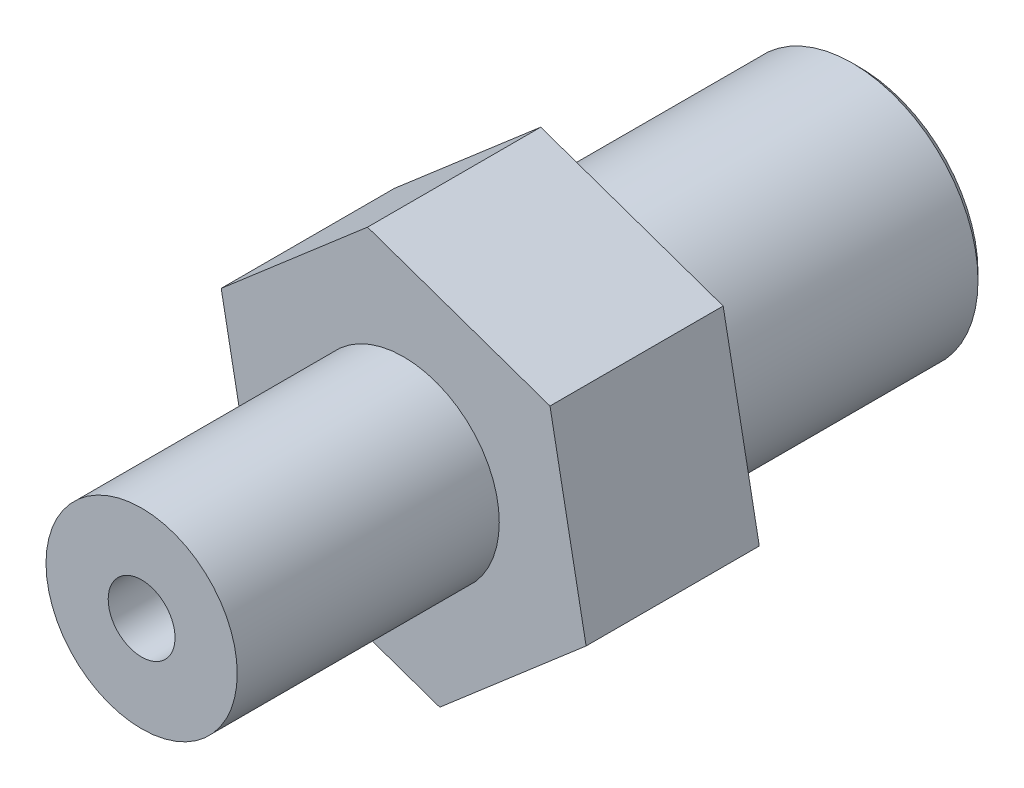
ISO-10303-21;
HEADER;
FILE_DESCRIPTION(('STEP AP214'),'2;1');
FILE_NAME('part.step','',(''),(''),'','','');
FILE_SCHEMA(('AUTOMOTIVE_DESIGN { 1 0 10303 214 1 1 1 1 }'));
ENDSEC;
DATA;
#1=APPLICATION_CONTEXT('core data for automotive mechanical design processes');
#2=APPLICATION_PROTOCOL_DEFINITION('international standard','automotive_design',2000,#1);
#3=PRODUCT_CONTEXT('',#1,'mechanical');
#4=PRODUCT('Part','Part','',(#3));
#5=PRODUCT_RELATED_PRODUCT_CATEGORY('part','',(#4));
#6=PRODUCT_DEFINITION_FORMATION('','',#4);
#7=PRODUCT_DEFINITION_CONTEXT('part definition',#1,'design');
#8=PRODUCT_DEFINITION('design','',#6,#7);
#9=PRODUCT_DEFINITION_SHAPE('','',#8);
#10=(LENGTH_UNIT() NAMED_UNIT(*) SI_UNIT(.MILLI.,.METRE.));
#11=(NAMED_UNIT(*) PLANE_ANGLE_UNIT() SI_UNIT($,.RADIAN.));
#12=(NAMED_UNIT(*) SI_UNIT($,.STERADIAN.) SOLID_ANGLE_UNIT());
#13=UNCERTAINTY_MEASURE_WITH_UNIT(LENGTH_MEASURE(1.E-05),#10,'distance_accuracy_value','');
#14=(GEOMETRIC_REPRESENTATION_CONTEXT(3) GLOBAL_UNCERTAINTY_ASSIGNED_CONTEXT((#13)) GLOBAL_UNIT_ASSIGNED_CONTEXT((#10,
#11,#12)) REPRESENTATION_CONTEXT('',''));
#15=CARTESIAN_POINT('',(0.,0.,0.));
#16=DIRECTION('',(0.,0.,1.));
#17=DIRECTION('',(1.,0.,0.));
#18=AXIS2_PLACEMENT_3D('',#15,#16,#17);
#19=CARTESIAN_POINT('',(6.05773660463347,-2.11338101444512,5.75));
#20=DIRECTION('',(-0.982393390626358,-0.1868240510578,0.));
#21=DIRECTION('',(0.1868240510578,-0.982393390626358,0.));
#22=AXIS2_PLACEMENT_3D('',#19,#20,#21);
#23=PLANE('',#22);
#24=DIRECTION('',(-0.1868240510578,0.982393390626358,0.));
#25=VECTOR('',#24,1.);
#26=CARTESIAN_POINT('',(6.05773660463347,-2.11338101444512,0.));
#27=LINE('',#26,#25);
#28=CARTESIAN_POINT('',(6.05773660463347,-2.11338101444512,0.));
#29=VERTEX_POINT('',#28);
#30=CARTESIAN_POINT('',(4.85910994870193,4.18946328182492,0.));
#31=VERTEX_POINT('',#30);
#32=EDGE_CURVE('E128',#29,#31,#27,.T.);
#33=ORIENTED_EDGE('',*,*,#32,.T.);
#34=DIRECTION('',(0.,0.,-1.));
#35=VECTOR('',#34,1.);
#36=CARTESIAN_POINT('',(4.85910994870193,4.18946328182492,5.75));
#37=LINE('',#36,#35);
#38=CARTESIAN_POINT('',(4.85910994870193,4.18946328182492,5.75));
#39=VERTEX_POINT('',#38);
#40=EDGE_CURVE('E146',#39,#31,#37,.T.);
#41=ORIENTED_EDGE('',*,*,#40,.F.);
#42=DIRECTION('',(-0.1868240510578,0.982393390626358,0.));
#43=VECTOR('',#42,1.);
#44=CARTESIAN_POINT('',(6.05773660463347,-2.11338101444512,5.75));
#45=LINE('',#44,#43);
#46=CARTESIAN_POINT('',(6.05773660463347,-2.11338101444512,5.75));
#47=VERTEX_POINT('',#46);
#48=EDGE_CURVE('E139',#47,#39,#45,.T.);
#49=ORIENTED_EDGE('',*,*,#48,.F.);
#50=DIRECTION('',(0.,0.,-1.));
#51=VECTOR('',#50,1.);
#52=CARTESIAN_POINT('',(6.05773660463347,-2.11338101444512,5.75));
#53=LINE('',#52,#51);
#54=EDGE_CURVE('E124',#47,#29,#53,.T.);
#55=ORIENTED_EDGE('',*,*,#54,.T.);
#56=EDGE_LOOP('',(#33,#41,#49,#55));
#57=FACE_BOUND('',#56,.T.);
#58=ADVANCED_FACE('F41',(#57),#23,.F.);
#59=CARTESIAN_POINT('',(4.85910994870193,4.18946328182492,5.75));
#60=DIRECTION('',(-0.329402321059203,-0.944189658321256,0.));
#61=DIRECTION('',(0.944189658321256,-0.329402321059203,0.));
#62=AXIS2_PLACEMENT_3D('',#59,#60,#61);
#63=PLANE('',#62);
#64=DIRECTION('',(-0.944189658321256,0.329402321059203,0.));
#65=VECTOR('',#64,1.);
#66=CARTESIAN_POINT('',(4.85910994870193,4.18946328182492,0.));
#67=LINE('',#66,#65);
#68=CARTESIAN_POINT('',(-1.19862665593154,6.30284429627004,0.));
#69=VERTEX_POINT('',#68);
#70=EDGE_CURVE('E131',#31,#69,#67,.T.);
#71=ORIENTED_EDGE('',*,*,#70,.T.);
#72=DIRECTION('',(0.,0.,-1.));
#73=VECTOR('',#72,1.);
#74=CARTESIAN_POINT('',(-1.19862665593154,6.30284429627004,5.75));
#75=LINE('',#74,#73);
#76=CARTESIAN_POINT('',(-1.19862665593154,6.30284429627004,5.75));
#77=VERTEX_POINT('',#76);
#78=EDGE_CURVE('E143',#77,#69,#75,.T.);
#79=ORIENTED_EDGE('',*,*,#78,.F.);
#80=DIRECTION('',(-0.944189658321256,0.329402321059203,0.));
#81=VECTOR('',#80,1.);
#82=CARTESIAN_POINT('',(4.85910994870193,4.18946328182492,5.75));
#83=LINE('',#82,#81);
#84=EDGE_CURVE('E97',#39,#77,#83,.T.);
#85=ORIENTED_EDGE('',*,*,#84,.F.);
#86=ORIENTED_EDGE('',*,*,#40,.T.);
#87=EDGE_LOOP('',(#71,#79,#85,#86));
#88=FACE_BOUND('',#87,.T.);
#89=ADVANCED_FACE('F181',(#88),#63,.F.);
#90=CARTESIAN_POINT('',(-1.19862665593154,6.30284429627004,5.75));
#91=DIRECTION('',(0.652991069567155,-0.757365607263456,0.));
#92=DIRECTION('',(0.757365607263456,0.652991069567155,0.));
#93=AXIS2_PLACEMENT_3D('',#90,#91,#92);
#94=PLANE('',#93);
#95=DIRECTION('',(-0.757365607263456,-0.652991069567155,0.));
#96=VECTOR('',#95,1.);
#97=CARTESIAN_POINT('',(-1.19862665593154,6.30284429627004,0.));
#98=LINE('',#97,#96);
#99=CARTESIAN_POINT('',(-6.05773660463348,2.11338101444512,0.));
#100=VERTEX_POINT('',#99);
#101=EDGE_CURVE('E134',#69,#100,#98,.T.);
#102=ORIENTED_EDGE('',*,*,#101,.T.);
#103=DIRECTION('',(0.,0.,-1.));
#104=VECTOR('',#103,1.);
#105=CARTESIAN_POINT('',(-6.05773660463348,2.11338101444512,5.75));
#106=LINE('',#105,#104);
#107=CARTESIAN_POINT('',(-6.05773660463348,2.11338101444512,5.75));
#108=VERTEX_POINT('',#107);
#109=EDGE_CURVE('E119',#108,#100,#106,.T.);
#110=ORIENTED_EDGE('',*,*,#109,.F.);
#111=DIRECTION('',(-0.757365607263456,-0.652991069567155,0.));
#112=VECTOR('',#111,1.);
#113=CARTESIAN_POINT('',(-1.19862665593154,6.30284429627004,5.75));
#114=LINE('',#113,#112);
#115=EDGE_CURVE('E110',#77,#108,#114,.T.);
#116=ORIENTED_EDGE('',*,*,#115,.F.);
#117=ORIENTED_EDGE('',*,*,#78,.T.);
#118=EDGE_LOOP('',(#102,#110,#116,#117));
#119=FACE_BOUND('',#118,.T.);
#120=ADVANCED_FACE('F187',(#119),#94,.F.);
#121=CARTESIAN_POINT('',(-6.05773660463348,2.11338101444512,5.75));
#122=DIRECTION('',(0.982393390626358,0.1868240510578,0.));
#123=DIRECTION('',(-0.1868240510578,0.982393390626358,0.));
#124=AXIS2_PLACEMENT_3D('',#121,#122,#123);
#125=PLANE('',#124);
#126=DIRECTION('',(0.1868240510578,-0.982393390626358,0.));
#127=VECTOR('',#126,1.);
#128=CARTESIAN_POINT('',(-6.05773660463348,2.11338101444512,0.));
#129=LINE('',#128,#127);
#130=CARTESIAN_POINT('',(-4.85910994870194,-4.18946328182492,0.));
#131=VERTEX_POINT('',#130);
#132=EDGE_CURVE('E118',#100,#131,#129,.T.);
#133=ORIENTED_EDGE('',*,*,#132,.T.);
#134=DIRECTION('',(0.,0.,-1.));
#135=VECTOR('',#134,1.);
#136=CARTESIAN_POINT('',(-4.85910994870194,-4.18946328182492,5.75));
#137=LINE('',#136,#135);
#138=CARTESIAN_POINT('',(-4.85910994870194,-4.18946328182492,5.75));
#139=VERTEX_POINT('',#138);
#140=EDGE_CURVE('E115',#139,#131,#137,.T.);
#141=ORIENTED_EDGE('',*,*,#140,.F.);
#142=DIRECTION('',(0.1868240510578,-0.982393390626358,0.));
#143=VECTOR('',#142,1.);
#144=CARTESIAN_POINT('',(-6.05773660463348,2.11338101444512,5.75));
#145=LINE('',#144,#143);
#146=EDGE_CURVE('E104',#108,#139,#145,.T.);
#147=ORIENTED_EDGE('',*,*,#146,.F.);
#148=ORIENTED_EDGE('',*,*,#109,.T.);
#149=EDGE_LOOP('',(#133,#141,#147,#148));
#150=FACE_BOUND('',#149,.T.);
#151=ADVANCED_FACE('F116',(#150),#125,.F.);
#152=CARTESIAN_POINT('',(-4.85910994870194,-4.18946328182492,5.75));
#153=DIRECTION('',(0.329402321059203,0.944189658321256,0.));
#154=DIRECTION('',(-0.944189658321256,0.329402321059203,0.));
#155=AXIS2_PLACEMENT_3D('',#152,#153,#154);
#156=PLANE('',#155);
#157=DIRECTION('',(0.944189658321256,-0.329402321059203,0.));
#158=VECTOR('',#157,1.);
#159=CARTESIAN_POINT('',(-4.85910994870194,-4.18946328182492,0.));
#160=LINE('',#159,#158);
#161=CARTESIAN_POINT('',(1.19862665593154,-6.30284429627004,0.));
#162=VERTEX_POINT('',#161);
#163=EDGE_CURVE('E82',#131,#162,#160,.T.);
#164=ORIENTED_EDGE('',*,*,#163,.T.);
#165=DIRECTION('',(0.,0.,-1.));
#166=VECTOR('',#165,1.);
#167=CARTESIAN_POINT('',(1.19862665593154,-6.30284429627004,5.75));
#168=LINE('',#167,#166);
#169=CARTESIAN_POINT('',(1.19862665593154,-6.30284429627004,5.75));
#170=VERTEX_POINT('',#169);
#171=EDGE_CURVE('E120',#170,#162,#168,.T.);
#172=ORIENTED_EDGE('',*,*,#171,.F.);
#173=DIRECTION('',(0.944189658321256,-0.329402321059203,0.));
#174=VECTOR('',#173,1.);
#175=CARTESIAN_POINT('',(-4.85910994870194,-4.18946328182492,5.75));
#176=LINE('',#175,#174);
#177=EDGE_CURVE('E108',#139,#170,#176,.T.);
#178=ORIENTED_EDGE('',*,*,#177,.F.);
#179=ORIENTED_EDGE('',*,*,#140,.T.);
#180=EDGE_LOOP('',(#164,#172,#178,#179));
#181=FACE_BOUND('',#180,.T.);
#182=ADVANCED_FACE('F122',(#181),#156,.F.);
#183=CARTESIAN_POINT('',(1.19862665593154,-6.30284429627004,5.75));
#184=DIRECTION('',(-0.652991069567155,0.757365607263455,0.));
#185=DIRECTION('',(-0.757365607263456,-0.652991069567155,0.));
#186=AXIS2_PLACEMENT_3D('',#183,#184,#185);
#187=PLANE('',#186);
#188=DIRECTION('',(0.757365607263456,0.652991069567155,0.));
#189=VECTOR('',#188,1.);
#190=CARTESIAN_POINT('',(1.19862665593154,-6.30284429627004,0.));
#191=LINE('',#190,#189);
#192=EDGE_CURVE('E88',#162,#29,#191,.T.);
#193=ORIENTED_EDGE('',*,*,#192,.T.);
#194=ORIENTED_EDGE('',*,*,#54,.F.);
#195=DIRECTION('',(0.757365607263456,0.652991069567155,0.));
#196=VECTOR('',#195,1.);
#197=CARTESIAN_POINT('',(1.19862665593154,-6.30284429627004,5.75));
#198=LINE('',#197,#196);
#199=EDGE_CURVE('E59',#170,#47,#198,.T.);
#200=ORIENTED_EDGE('',*,*,#199,.F.);
#201=ORIENTED_EDGE('',*,*,#171,.T.);
#202=EDGE_LOOP('',(#193,#194,#200,#201));
#203=FACE_BOUND('',#202,.T.);
#204=ADVANCED_FACE('F204',(#203),#187,.F.);
#205=CARTESIAN_POINT('',(0.,0.,5.75));
#206=DIRECTION('',(0.,0.,1.));
#207=DIRECTION('',(1.,0.,0.));
#208=AXIS2_PLACEMENT_3D('',#205,#206,#207);
#209=PLANE('',#208);
#210=CARTESIAN_POINT('',(0.,0.,5.75));
#211=DIRECTION('',(0.,0.,1.));
#212=DIRECTION('',(1.,0.,0.));
#213=AXIS2_PLACEMENT_3D('',#210,#211,#212);
#214=CIRCLE('',#213,3.175);
#215=CARTESIAN_POINT('',(3.175,0.,5.75));
#216=VERTEX_POINT('',#215);
#217=EDGE_CURVE('E148',#216,#216,#214,.T.);
#218=ORIENTED_EDGE('',*,*,#217,.F.);
#219=EDGE_LOOP('',(#218));
#220=FACE_BOUND('',#219,.T.);
#221=ORIENTED_EDGE('',*,*,#48,.T.);
#222=ORIENTED_EDGE('',*,*,#84,.T.);
#223=ORIENTED_EDGE('',*,*,#115,.T.);
#224=ORIENTED_EDGE('',*,*,#146,.T.);
#225=ORIENTED_EDGE('',*,*,#177,.T.);
#226=ORIENTED_EDGE('',*,*,#199,.T.);
#227=EDGE_LOOP('',(#221,#222,#223,#224,#225,#226));
#228=FACE_BOUND('',#227,.T.);
#229=ADVANCED_FACE('F106',(#220,#228),#209,.T.);
#230=CARTESIAN_POINT('',(0.,0.,0.));
#231=DIRECTION('',(0.,0.,1.));
#232=DIRECTION('',(1.,0.,0.));
#233=AXIS2_PLACEMENT_3D('',#230,#231,#232);
#234=PLANE('',#233);
#235=CARTESIAN_POINT('',(0.,0.,0.));
#236=DIRECTION('',(0.,0.,1.));
#237=DIRECTION('',(1.,0.,0.));
#238=AXIS2_PLACEMENT_3D('',#235,#236,#237);
#239=CIRCLE('',#238,4.42);
#240=CARTESIAN_POINT('',(4.42,0.,0.));
#241=VERTEX_POINT('',#240);
#242=EDGE_CURVE('E155',#241,#241,#239,.T.);
#243=ORIENTED_EDGE('',*,*,#242,.T.);
#244=EDGE_LOOP('',(#243));
#245=FACE_BOUND('',#244,.T.);
#246=ORIENTED_EDGE('',*,*,#32,.F.);
#247=ORIENTED_EDGE('',*,*,#192,.F.);
#248=ORIENTED_EDGE('',*,*,#163,.F.);
#249=ORIENTED_EDGE('',*,*,#132,.F.);
#250=ORIENTED_EDGE('',*,*,#101,.F.);
#251=ORIENTED_EDGE('',*,*,#70,.F.);
#252=EDGE_LOOP('',(#246,#247,#248,#249,#250,#251));
#253=FACE_BOUND('',#252,.T.);
#254=ADVANCED_FACE('F207',(#245,#253),#234,.F.);
#255=CARTESIAN_POINT('',(0.,0.,14.45));
#256=DIRECTION('',(0.,0.,-1.));
#257=DIRECTION('',(-1.,0.,0.));
#258=AXIS2_PLACEMENT_3D('',#255,#256,#257);
#259=CYLINDRICAL_SURFACE('',#258,3.175);
#260=CARTESIAN_POINT('',(0.,0.,14.45));
#261=DIRECTION('',(0.,0.,1.));
#262=DIRECTION('',(1.,0.,0.));
#263=AXIS2_PLACEMENT_3D('',#260,#261,#262);
#264=CIRCLE('',#263,3.175);
#265=CARTESIAN_POINT('',(3.175,0.,14.45));
#266=VERTEX_POINT('',#265);
#267=EDGE_CURVE('E132',#266,#266,#264,.T.);
#268=ORIENTED_EDGE('',*,*,#267,.F.);
#269=EDGE_LOOP('',(#268));
#270=FACE_BOUND('',#269,.T.);
#271=ORIENTED_EDGE('',*,*,#217,.T.);
#272=EDGE_LOOP('',(#271));
#273=FACE_BOUND('',#272,.T.);
#274=ADVANCED_FACE('F210',(#270,#273),#259,.T.);
#275=CARTESIAN_POINT('',(0.,0.,14.45));
#276=DIRECTION('',(0.,0.,1.));
#277=DIRECTION('',(1.,0.,0.));
#278=AXIS2_PLACEMENT_3D('',#275,#276,#277);
#279=PLANE('',#278);
#280=CARTESIAN_POINT('',(0.,0.,14.45));
#281=DIRECTION('',(0.,0.,-1.));
#282=DIRECTION('',(-1.,0.,0.));
#283=AXIS2_PLACEMENT_3D('',#280,#281,#282);
#284=CIRCLE('',#283,1.11);
#285=CARTESIAN_POINT('',(-1.11,0.,14.45));
#286=VERTEX_POINT('',#285);
#287=EDGE_CURVE('E236',#286,#286,#284,.T.);
#288=ORIENTED_EDGE('',*,*,#287,.T.);
#289=EDGE_LOOP('',(#288));
#290=FACE_BOUND('',#289,.T.);
#291=ORIENTED_EDGE('',*,*,#267,.T.);
#292=EDGE_LOOP('',(#291));
#293=FACE_BOUND('',#292,.T.);
#294=ADVANCED_FACE('F217',(#290,#293),#279,.T.);
#295=CARTESIAN_POINT('',(0.,0.,-9.4));
#296=DIRECTION('',(0.,0.,1.));
#297=DIRECTION('',(1.,0.,0.));
#298=AXIS2_PLACEMENT_3D('',#295,#296,#297);
#299=CYLINDRICAL_SURFACE('',#298,4.17);
#300=CARTESIAN_POINT('',(0.,0.,-0.250000000000002));
#301=DIRECTION('',(0.,0.,1.));
#302=DIRECTION('',(1.,0.,0.));
#303=AXIS2_PLACEMENT_3D('',#300,#301,#302);
#304=CIRCLE('',#303,4.17);
#305=CARTESIAN_POINT('',(4.17,0.,-0.250000000000002));
#306=VERTEX_POINT('',#305);
#307=EDGE_CURVE('E152',#306,#306,#304,.F.);
#308=ORIENTED_EDGE('',*,*,#307,.T.);
#309=EDGE_LOOP('',(#308));
#310=FACE_BOUND('',#309,.T.);
#311=CARTESIAN_POINT('',(0.,0.,-9.15));
#312=DIRECTION('',(0.,0.,-1.));
#313=DIRECTION('',(-1.,0.,0.));
#314=AXIS2_PLACEMENT_3D('',#311,#312,#313);
#315=CIRCLE('',#314,4.17);
#316=CARTESIAN_POINT('',(-4.17,0.,-9.15));
#317=VERTEX_POINT('',#316);
#318=EDGE_CURVE('E149',#317,#317,#315,.F.);
#319=ORIENTED_EDGE('',*,*,#318,.T.);
#320=EDGE_LOOP('',(#319));
#321=FACE_BOUND('',#320,.T.);
#322=ADVANCED_FACE('F221',(#310,#321),#299,.T.);
#323=CARTESIAN_POINT('',(0.,0.,-9.4));
#324=DIRECTION('',(0.,0.,-1.));
#325=DIRECTION('',(-1.,0.,0.));
#326=AXIS2_PLACEMENT_3D('',#323,#324,#325);
#327=PLANE('',#326);
#328=CARTESIAN_POINT('',(0.,0.,-9.4));
#329=DIRECTION('',(0.,0.,-1.));
#330=DIRECTION('',(-1.,0.,0.));
#331=AXIS2_PLACEMENT_3D('',#328,#329,#330);
#332=CIRCLE('',#331,3.92);
#333=CARTESIAN_POINT('',(-3.92,0.,-9.4));
#334=VERTEX_POINT('',#333);
#335=EDGE_CURVE('E51',#334,#334,#332,.T.);
#336=ORIENTED_EDGE('',*,*,#335,.T.);
#337=EDGE_LOOP('',(#336));
#338=FACE_BOUND('',#337,.T.);
#339=CARTESIAN_POINT('',(0.,0.,-9.4));
#340=DIRECTION('',(0.,0.,-1.));
#341=DIRECTION('',(-1.,0.,0.));
#342=AXIS2_PLACEMENT_3D('',#339,#340,#341);
#343=CIRCLE('',#342,1.36);
#344=CARTESIAN_POINT('',(-1.36,0.,-9.4));
#345=VERTEX_POINT('',#344);
#346=EDGE_CURVE('E158',#345,#345,#343,.F.);
#347=ORIENTED_EDGE('',*,*,#346,.T.);
#348=EDGE_LOOP('',(#347));
#349=FACE_BOUND('',#348,.T.);
#350=ADVANCED_FACE('F163',(#338,#349),#327,.T.);
#351=CARTESIAN_POINT('',(0.,0.,14.45));
#352=DIRECTION('',(0.,0.,-1.));
#353=DIRECTION('',(-1.,0.,0.));
#354=AXIS2_PLACEMENT_3D('',#351,#352,#353);
#355=CYLINDRICAL_SURFACE('',#354,1.11);
#356=CARTESIAN_POINT('',(0.,0.,-9.15));
#357=DIRECTION('',(0.,0.,-1.));
#358=DIRECTION('',(-1.,0.,0.));
#359=AXIS2_PLACEMENT_3D('',#356,#357,#358);
#360=CIRCLE('',#359,1.11);
#361=CARTESIAN_POINT('',(-1.11,0.,-9.15));
#362=VERTEX_POINT('',#361);
#363=EDGE_CURVE('E11',#362,#362,#360,.T.);
#364=ORIENTED_EDGE('',*,*,#363,.T.);
#365=EDGE_LOOP('',(#364));
#366=FACE_BOUND('',#365,.T.);
#367=ORIENTED_EDGE('',*,*,#287,.F.);
#368=EDGE_LOOP('',(#367));
#369=FACE_BOUND('',#368,.T.);
#370=ADVANCED_FACE('F175',(#366,#369),#355,.F.);
#371=CARTESIAN_POINT('',(0.,0.,-0.250000000000002));
#372=DIRECTION('',(0.,0.,1.));
#373=DIRECTION('',(1.,0.,0.));
#374=AXIS2_PLACEMENT_3D('',#371,#372,#373);
#375=CONICAL_SURFACE('',#374,4.17,0.785398163397445);
#376=ORIENTED_EDGE('',*,*,#242,.F.);
#377=EDGE_LOOP('',(#376));
#378=FACE_BOUND('',#377,.T.);
#379=ORIENTED_EDGE('',*,*,#307,.F.);
#380=EDGE_LOOP('',(#379));
#381=FACE_BOUND('',#380,.T.);
#382=ADVANCED_FACE('F168',(#378,#381),#375,.T.);
#383=CARTESIAN_POINT('',(0.,0.,-9.4));
#384=DIRECTION('',(0.,0.,1.));
#385=DIRECTION('',(1.,0.,0.));
#386=AXIS2_PLACEMENT_3D('',#383,#384,#385);
#387=CONICAL_SURFACE('',#386,3.92,0.785398163397448);
#388=ORIENTED_EDGE('',*,*,#318,.F.);
#389=EDGE_LOOP('',(#388));
#390=FACE_BOUND('',#389,.T.);
#391=ORIENTED_EDGE('',*,*,#335,.F.);
#392=EDGE_LOOP('',(#391));
#393=FACE_BOUND('',#392,.T.);
#394=ADVANCED_FACE('F166',(#390,#393),#387,.T.);
#395=CARTESIAN_POINT('',(0.,0.,-9.15));
#396=DIRECTION('',(0.,0.,-1.));
#397=DIRECTION('',(-1.,0.,0.));
#398=AXIS2_PLACEMENT_3D('',#395,#396,#397);
#399=CONICAL_SURFACE('',#398,1.11,0.785398163397454);
#400=ORIENTED_EDGE('',*,*,#346,.F.);
#401=EDGE_LOOP('',(#400));
#402=FACE_BOUND('',#401,.T.);
#403=ORIENTED_EDGE('',*,*,#363,.F.);
#404=EDGE_LOOP('',(#403));
#405=FACE_BOUND('',#404,.T.);
#406=ADVANCED_FACE('F44',(#402,#405),#399,.F.);
#407=CLOSED_SHELL('',(#58,#89,#120,#151,#182,#204,#229,#254,#274,#294,#322,#350,#370,#382,#394,#406));
#408=MANIFOLD_SOLID_BREP('B2',#407);
#409=ADVANCED_BREP_SHAPE_REPRESENTATION('',(#18,#408),#14);
#410=SHAPE_DEFINITION_REPRESENTATION(#9,#409);
ENDSEC;
END-ISO-10303-21;
